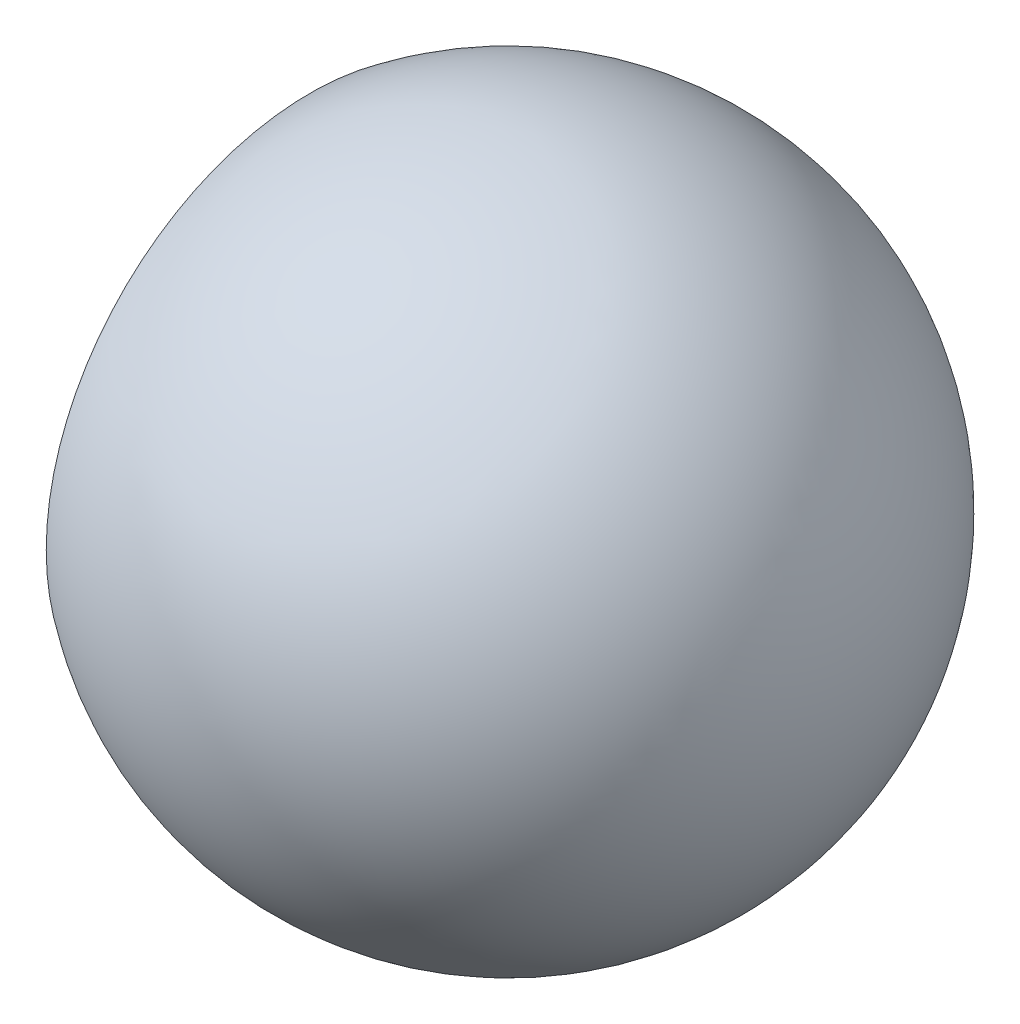
ISO-10303-21;
HEADER;
FILE_DESCRIPTION(('STEP AP214'),'2;1');
FILE_NAME('part.step','',(''),(''),'','','');
FILE_SCHEMA(('AUTOMOTIVE_DESIGN { 1 0 10303 214 1 1 1 1 }'));
ENDSEC;
DATA;
#1=APPLICATION_CONTEXT('core data for automotive mechanical design processes');
#2=APPLICATION_PROTOCOL_DEFINITION('international standard','automotive_design',2000,#1);
#3=PRODUCT_CONTEXT('',#1,'mechanical');
#4=PRODUCT('Part','Part','',(#3));
#5=PRODUCT_RELATED_PRODUCT_CATEGORY('part','',(#4));
#6=PRODUCT_DEFINITION_FORMATION('','',#4);
#7=PRODUCT_DEFINITION_CONTEXT('part definition',#1,'design');
#8=PRODUCT_DEFINITION('design','',#6,#7);
#9=PRODUCT_DEFINITION_SHAPE('','',#8);
#10=(LENGTH_UNIT() NAMED_UNIT(*) SI_UNIT(.MILLI.,.METRE.));
#11=(NAMED_UNIT(*) PLANE_ANGLE_UNIT() SI_UNIT($,.RADIAN.));
#12=(NAMED_UNIT(*) SI_UNIT($,.STERADIAN.) SOLID_ANGLE_UNIT());
#13=UNCERTAINTY_MEASURE_WITH_UNIT(LENGTH_MEASURE(1.E-05),#10,'distance_accuracy_value','');
#14=(GEOMETRIC_REPRESENTATION_CONTEXT(3) GLOBAL_UNCERTAINTY_ASSIGNED_CONTEXT((#13)) GLOBAL_UNIT_ASSIGNED_CONTEXT((#10,
#11,#12)) REPRESENTATION_CONTEXT('',''));
#15=CARTESIAN_POINT('',(0.,0.,0.));
#16=DIRECTION('',(0.,0.,1.));
#17=DIRECTION('',(1.,0.,0.));
#18=AXIS2_PLACEMENT_3D('',#15,#16,#17);
#19=CARTESIAN_POINT('',(-6.,0.,0.));
#20=DIRECTION('',(-1.,0.,0.));
#21=DIRECTION('',(0.,0.,1.));
#22=AXIS2_PLACEMENT_3D('',#19,#20,#21);
#23=PLANE('',#22);
#24=CARTESIAN_POINT('',(-6.,0.,0.));
#25=DIRECTION('',(-1.,0.,0.));
#26=DIRECTION('',(0.,0.,1.));
#27=AXIS2_PLACEMENT_3D('',#24,#25,#26);
#28=CIRCLE('',#27,8.);
#29=CARTESIAN_POINT('',(-6.,0.,8.));
#30=VERTEX_POINT('',#29);
#31=EDGE_CURVE('E10',#30,#30,#28,.T.);
#32=ORIENTED_EDGE('',*,*,#31,.T.);
#33=EDGE_LOOP('',(#32));
#34=FACE_BOUND('',#33,.T.);
#35=ADVANCED_FACE('F41',(#34),#23,.T.);
#36=CARTESIAN_POINT('',(0.,0.,0.));
#37=DIRECTION('',(-1.,0.,0.));
#38=DIRECTION('',(0.,-1.,0.));
#39=AXIS2_PLACEMENT_3D('',#36,#37,#38);
#40=SPHERICAL_SURFACE('',#39,10.);
#41=ORIENTED_EDGE('',*,*,#31,.F.);
#42=EDGE_LOOP('',(#41));
#43=FACE_BOUND('',#42,.T.);
#44=ADVANCED_FACE('F50',(#43),#40,.T.);
#45=CLOSED_SHELL('',(#35,#44));
#46=MANIFOLD_SOLID_BREP('B2',#45);
#47=ADVANCED_BREP_SHAPE_REPRESENTATION('',(#18,#46),#14);
#48=SHAPE_DEFINITION_REPRESENTATION(#9,#47);
ENDSEC;
END-ISO-10303-21;
